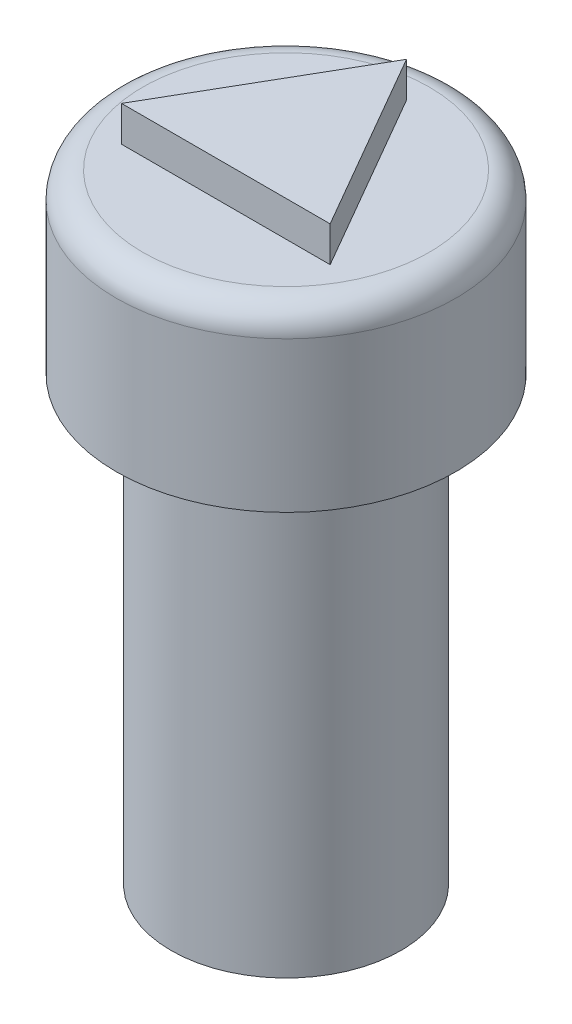
ISO-10303-21;
HEADER;
FILE_DESCRIPTION(('STEP AP214'),'2;1');
FILE_NAME('part.step','',(''),(''),'','','');
FILE_SCHEMA(('AUTOMOTIVE_DESIGN { 1 0 10303 214 1 1 1 1 }'));
ENDSEC;
DATA;
#1=APPLICATION_CONTEXT('core data for automotive mechanical design processes');
#2=APPLICATION_PROTOCOL_DEFINITION('international standard','automotive_design',2000,#1);
#3=PRODUCT_CONTEXT('',#1,'mechanical');
#4=PRODUCT('Part','Part','',(#3));
#5=PRODUCT_RELATED_PRODUCT_CATEGORY('part','',(#4));
#6=PRODUCT_DEFINITION_FORMATION('','',#4);
#7=PRODUCT_DEFINITION_CONTEXT('part definition',#1,'design');
#8=PRODUCT_DEFINITION('design','',#6,#7);
#9=PRODUCT_DEFINITION_SHAPE('','',#8);
#10=(LENGTH_UNIT() NAMED_UNIT(*) SI_UNIT(.MILLI.,.METRE.));
#11=(NAMED_UNIT(*) PLANE_ANGLE_UNIT() SI_UNIT($,.RADIAN.));
#12=(NAMED_UNIT(*) SI_UNIT($,.STERADIAN.) SOLID_ANGLE_UNIT());
#13=UNCERTAINTY_MEASURE_WITH_UNIT(LENGTH_MEASURE(1.E-05),#10,'distance_accuracy_value','');
#14=(GEOMETRIC_REPRESENTATION_CONTEXT(3) GLOBAL_UNCERTAINTY_ASSIGNED_CONTEXT((#13)) GLOBAL_UNIT_ASSIGNED_CONTEXT((#10,
#11,#12)) REPRESENTATION_CONTEXT('',''));
#15=CARTESIAN_POINT('',(0.,0.,0.));
#16=DIRECTION('',(0.,0.,1.));
#17=DIRECTION('',(1.,0.,0.));
#18=AXIS2_PLACEMENT_3D('',#15,#16,#17);
#19=CARTESIAN_POINT('',(0.,12.5,0.));
#20=DIRECTION('',(0.,-1.,0.));
#21=DIRECTION('',(0.,0.,-1.));
#22=AXIS2_PLACEMENT_3D('',#19,#20,#21);
#23=CYLINDRICAL_SURFACE('',#22,3.25);
#24=CARTESIAN_POINT('',(0.,12.5,0.));
#25=DIRECTION('',(0.,1.,0.));
#26=DIRECTION('',(0.,0.,1.));
#27=AXIS2_PLACEMENT_3D('',#24,#25,#26);
#28=CIRCLE('',#27,3.25);
#29=CARTESIAN_POINT('',(0.,12.5,3.25));
#30=VERTEX_POINT('',#29);
#31=EDGE_CURVE('E167',#30,#30,#28,.T.);
#32=ORIENTED_EDGE('',*,*,#31,.F.);
#33=EDGE_LOOP('',(#32));
#34=FACE_BOUND('',#33,.T.);
#35=CARTESIAN_POINT('',(0.,0.,0.));
#36=DIRECTION('',(0.,1.,0.));
#37=DIRECTION('',(0.,0.,1.));
#38=AXIS2_PLACEMENT_3D('',#35,#36,#37);
#39=CIRCLE('',#38,3.25);
#40=CARTESIAN_POINT('',(0.,0.,3.25));
#41=VERTEX_POINT('',#40);
#42=EDGE_CURVE('E164',#41,#41,#39,.T.);
#43=ORIENTED_EDGE('',*,*,#42,.T.);
#44=EDGE_LOOP('',(#43));
#45=FACE_BOUND('',#44,.T.);
#46=ADVANCED_FACE('F99',(#34,#45),#23,.T.);
#47=CARTESIAN_POINT('',(0.,0.,0.));
#48=DIRECTION('',(0.,1.,0.));
#49=DIRECTION('',(0.,0.,1.));
#50=AXIS2_PLACEMENT_3D('',#47,#48,#49);
#51=PLANE('',#50);
#52=CARTESIAN_POINT('',(0.,0.,0.));
#53=DIRECTION('',(0.,-1.,0.));
#54=DIRECTION('',(0.,0.,-1.));
#55=AXIS2_PLACEMENT_3D('',#52,#53,#54);
#56=CIRCLE('',#55,1.75);
#57=CARTESIAN_POINT('',(0.,0.,-1.75));
#58=VERTEX_POINT('',#57);
#59=EDGE_CURVE('E155',#58,#58,#56,.T.);
#60=ORIENTED_EDGE('',*,*,#59,.F.);
#61=EDGE_LOOP('',(#60));
#62=FACE_BOUND('',#61,.T.);
#63=ORIENTED_EDGE('',*,*,#42,.F.);
#64=EDGE_LOOP('',(#63));
#65=FACE_BOUND('',#64,.T.);
#66=ADVANCED_FACE('F186',(#62,#65),#51,.F.);
#67=CARTESIAN_POINT('',(0.,2.5,0.));
#68=DIRECTION('',(0.,-1.,0.));
#69=DIRECTION('',(0.,0.,-1.));
#70=AXIS2_PLACEMENT_3D('',#67,#68,#69);
#71=CYLINDRICAL_SURFACE('',#70,1.75);
#72=CARTESIAN_POINT('',(0.,2.5,0.));
#73=DIRECTION('',(0.,-1.,0.));
#74=DIRECTION('',(0.,0.,-1.));
#75=AXIS2_PLACEMENT_3D('',#72,#73,#74);
#76=CIRCLE('',#75,1.75);
#77=CARTESIAN_POINT('',(0.,2.5,-1.75));
#78=VERTEX_POINT('',#77);
#79=EDGE_CURVE('E161',#78,#78,#76,.T.);
#80=ORIENTED_EDGE('',*,*,#79,.F.);
#81=EDGE_LOOP('',(#80));
#82=FACE_BOUND('',#81,.T.);
#83=ORIENTED_EDGE('',*,*,#59,.T.);
#84=EDGE_LOOP('',(#83));
#85=FACE_BOUND('',#84,.T.);
#86=ADVANCED_FACE('F191',(#82,#85),#71,.F.);
#87=CARTESIAN_POINT('',(0.,2.5,0.));
#88=DIRECTION('',(0.,-1.,0.));
#89=DIRECTION('',(0.,0.,-1.));
#90=AXIS2_PLACEMENT_3D('',#87,#88,#89);
#91=PLANE('',#90);
#92=ORIENTED_EDGE('',*,*,#79,.T.);
#93=EDGE_LOOP('',(#92));
#94=FACE_BOUND('',#93,.T.);
#95=ADVANCED_FACE('F199',(#94),#91,.T.);
#96=CARTESIAN_POINT('',(0.,17.5,0.));
#97=DIRECTION('',(0.,-1.,0.));
#98=DIRECTION('',(0.,0.,-1.));
#99=AXIS2_PLACEMENT_3D('',#96,#97,#98);
#100=CYLINDRICAL_SURFACE('',#99,4.8);
#101=CARTESIAN_POINT('',(0.,16.75,0.));
#102=DIRECTION('',(0.,1.,0.));
#103=DIRECTION('',(0.,0.,1.));
#104=AXIS2_PLACEMENT_3D('',#101,#102,#103);
#105=CIRCLE('',#104,4.8);
#106=CARTESIAN_POINT('',(0.,16.75,4.8));
#107=VERTEX_POINT('',#106);
#108=EDGE_CURVE('E12',#107,#107,#105,.F.);
#109=ORIENTED_EDGE('',*,*,#108,.T.);
#110=EDGE_LOOP('',(#109));
#111=FACE_BOUND('',#110,.T.);
#112=CARTESIAN_POINT('',(0.,12.5,0.));
#113=DIRECTION('',(0.,1.,0.));
#114=DIRECTION('',(0.,0.,1.));
#115=AXIS2_PLACEMENT_3D('',#112,#113,#114);
#116=CIRCLE('',#115,4.8);
#117=CARTESIAN_POINT('',(0.,12.5,4.8));
#118=VERTEX_POINT('',#117);
#119=EDGE_CURVE('E152',#118,#118,#116,.T.);
#120=ORIENTED_EDGE('',*,*,#119,.T.);
#121=EDGE_LOOP('',(#120));
#122=FACE_BOUND('',#121,.T.);
#123=ADVANCED_FACE('F203',(#111,#122),#100,.T.);
#124=CARTESIAN_POINT('',(0.,17.5,0.));
#125=DIRECTION('',(0.,1.,0.));
#126=DIRECTION('',(0.,0.,1.));
#127=AXIS2_PLACEMENT_3D('',#124,#125,#126);
#128=PLANE('',#127);
#129=CARTESIAN_POINT('',(0.,17.5,0.));
#130=DIRECTION('',(0.,1.,0.));
#131=DIRECTION('',(0.,0.,1.));
#132=AXIS2_PLACEMENT_3D('',#129,#130,#131);
#133=CIRCLE('',#132,4.05);
#134=CARTESIAN_POINT('',(0.,17.5,4.05));
#135=VERTEX_POINT('',#134);
#136=EDGE_CURVE('E107',#135,#135,#133,.T.);
#137=ORIENTED_EDGE('',*,*,#136,.T.);
#138=EDGE_LOOP('',(#137));
#139=FACE_BOUND('',#138,.T.);
#140=DIRECTION('',(1.,0.,0.));
#141=VECTOR('',#140,1.);
#142=CARTESIAN_POINT('',(-2.95,17.5,1.7031832941094));
#143=LINE('',#142,#141);
#144=CARTESIAN_POINT('',(-2.95,17.5,1.7031832941094));
#145=VERTEX_POINT('',#144);
#146=CARTESIAN_POINT('',(2.95,17.5,1.7031832941094));
#147=VERTEX_POINT('',#146);
#148=EDGE_CURVE('E114',#145,#147,#143,.T.);
#149=ORIENTED_EDGE('',*,*,#148,.F.);
#150=DIRECTION('',(-0.500000000000001,0.,0.866025403784438));
#151=VECTOR('',#150,1.);
#152=CARTESIAN_POINT('',(0.,17.5,-3.40636658821879));
#153=LINE('',#152,#151);
#154=CARTESIAN_POINT('',(0.,17.5,-3.40636658821879));
#155=VERTEX_POINT('',#154);
#156=EDGE_CURVE('E149',#155,#145,#153,.T.);
#157=ORIENTED_EDGE('',*,*,#156,.F.);
#158=DIRECTION('',(-0.499999999999999,0.,-0.866025403784439));
#159=VECTOR('',#158,1.);
#160=CARTESIAN_POINT('',(2.95,17.5,1.7031832941094));
#161=LINE('',#160,#159);
#162=EDGE_CURVE('E118',#147,#155,#161,.T.);
#163=ORIENTED_EDGE('',*,*,#162,.F.);
#164=EDGE_LOOP('',(#149,#157,#163));
#165=FACE_BOUND('',#164,.T.);
#166=ADVANCED_FACE('F174',(#139,#165),#128,.T.);
#167=CARTESIAN_POINT('',(0.,12.5,0.));
#168=DIRECTION('',(0.,1.,0.));
#169=DIRECTION('',(0.,0.,1.));
#170=AXIS2_PLACEMENT_3D('',#167,#168,#169);
#171=PLANE('',#170);
#172=ORIENTED_EDGE('',*,*,#31,.T.);
#173=EDGE_LOOP('',(#172));
#174=FACE_BOUND('',#173,.T.);
#175=ORIENTED_EDGE('',*,*,#119,.F.);
#176=EDGE_LOOP('',(#175));
#177=FACE_BOUND('',#176,.T.);
#178=ADVANCED_FACE('F208',(#174,#177),#171,.F.);
#179=CARTESIAN_POINT('',(-2.95,18.5,1.7031832941094));
#180=DIRECTION('',(0.,0.,-1.));
#181=DIRECTION('',(-1.,0.,0.));
#182=AXIS2_PLACEMENT_3D('',#179,#180,#181);
#183=PLANE('',#182);
#184=ORIENTED_EDGE('',*,*,#148,.T.);
#185=DIRECTION('',(0.,-1.,0.));
#186=VECTOR('',#185,1.);
#187=CARTESIAN_POINT('',(2.95,18.5,1.7031832941094));
#188=LINE('',#187,#186);
#189=CARTESIAN_POINT('',(2.95,18.5,1.7031832941094));
#190=VERTEX_POINT('',#189);
#191=EDGE_CURVE('E136',#190,#147,#188,.T.);
#192=ORIENTED_EDGE('',*,*,#191,.F.);
#193=DIRECTION('',(1.,0.,0.));
#194=VECTOR('',#193,1.);
#195=CARTESIAN_POINT('',(-2.95,18.5,1.7031832941094));
#196=LINE('',#195,#194);
#197=CARTESIAN_POINT('',(-2.95,18.5,1.7031832941094));
#198=VERTEX_POINT('',#197);
#199=EDGE_CURVE('E142',#198,#190,#196,.T.);
#200=ORIENTED_EDGE('',*,*,#199,.F.);
#201=DIRECTION('',(0.,-1.,0.));
#202=VECTOR('',#201,1.);
#203=CARTESIAN_POINT('',(-2.95,18.5,1.7031832941094));
#204=LINE('',#203,#202);
#205=EDGE_CURVE('E157',#198,#145,#204,.T.);
#206=ORIENTED_EDGE('',*,*,#205,.T.);
#207=EDGE_LOOP('',(#184,#192,#200,#206));
#208=FACE_BOUND('',#207,.T.);
#209=ADVANCED_FACE('F151',(#208),#183,.F.);
#210=CARTESIAN_POINT('',(2.95,18.5,1.7031832941094));
#211=DIRECTION('',(-0.866025403784439,0.,0.5));
#212=DIRECTION('',(0.5,0.,0.866025403784439));
#213=AXIS2_PLACEMENT_3D('',#210,#211,#212);
#214=PLANE('',#213);
#215=ORIENTED_EDGE('',*,*,#162,.T.);
#216=DIRECTION('',(0.,-1.,0.));
#217=VECTOR('',#216,1.);
#218=CARTESIAN_POINT('',(0.,18.5,-3.40636658821879));
#219=LINE('',#218,#217);
#220=CARTESIAN_POINT('',(0.,18.5,-3.40636658821879));
#221=VERTEX_POINT('',#220);
#222=EDGE_CURVE('E138',#221,#155,#219,.T.);
#223=ORIENTED_EDGE('',*,*,#222,.F.);
#224=DIRECTION('',(-0.499999999999999,0.,-0.866025403784439));
#225=VECTOR('',#224,1.);
#226=CARTESIAN_POINT('',(2.95,18.5,1.7031832941094));
#227=LINE('',#226,#225);
#228=EDGE_CURVE('E132',#190,#221,#227,.T.);
#229=ORIENTED_EDGE('',*,*,#228,.F.);
#230=ORIENTED_EDGE('',*,*,#191,.T.);
#231=EDGE_LOOP('',(#215,#223,#229,#230));
#232=FACE_BOUND('',#231,.T.);
#233=ADVANCED_FACE('F134',(#232),#214,.F.);
#234=CARTESIAN_POINT('',(0.,18.5,-3.40636658821879));
#235=DIRECTION('',(0.866025403784438,0.,0.500000000000001));
#236=DIRECTION('',(0.500000000000001,0.,-0.866025403784438));
#237=AXIS2_PLACEMENT_3D('',#234,#235,#236);
#238=PLANE('',#237);
#239=ORIENTED_EDGE('',*,*,#156,.T.);
#240=ORIENTED_EDGE('',*,*,#205,.F.);
#241=DIRECTION('',(-0.500000000000001,0.,0.866025403784438));
#242=VECTOR('',#241,1.);
#243=CARTESIAN_POINT('',(0.,18.5,-3.40636658821879));
#244=LINE('',#243,#242);
#245=EDGE_CURVE('E141',#221,#198,#244,.T.);
#246=ORIENTED_EDGE('',*,*,#245,.F.);
#247=ORIENTED_EDGE('',*,*,#222,.T.);
#248=EDGE_LOOP('',(#239,#240,#246,#247));
#249=FACE_BOUND('',#248,.T.);
#250=ADVANCED_FACE('F182',(#249),#238,.F.);
#251=CARTESIAN_POINT('',(0.,18.5,0.));
#252=DIRECTION('',(0.,1.,0.));
#253=DIRECTION('',(0.,0.,1.));
#254=AXIS2_PLACEMENT_3D('',#251,#252,#253);
#255=PLANE('',#254);
#256=ORIENTED_EDGE('',*,*,#199,.T.);
#257=ORIENTED_EDGE('',*,*,#228,.T.);
#258=ORIENTED_EDGE('',*,*,#245,.T.);
#259=EDGE_LOOP('',(#256,#257,#258));
#260=FACE_BOUND('',#259,.T.);
#261=ADVANCED_FACE('F145',(#260),#255,.T.);
#262=CARTESIAN_POINT('',(0.,16.75,0.));
#263=DIRECTION('',(0.,1.,0.));
#264=DIRECTION('',(0.,0.,1.));
#265=AXIS2_PLACEMENT_3D('',#262,#263,#264);
#266=TOROIDAL_SURFACE('',#265,4.05,0.75);
#267=ORIENTED_EDGE('',*,*,#108,.F.);
#268=EDGE_LOOP('',(#267));
#269=FACE_BOUND('',#268,.T.);
#270=ORIENTED_EDGE('',*,*,#136,.F.);
#271=EDGE_LOOP('',(#270));
#272=FACE_BOUND('',#271,.T.);
#273=ADVANCED_FACE('F101',(#269,#272),#266,.T.);
#274=CLOSED_SHELL('',(#46,#66,#86,#95,#123,#166,#178,#209,#233,#250,#261,#273));
#275=MANIFOLD_SOLID_BREP('B2',#274);
#276=ADVANCED_BREP_SHAPE_REPRESENTATION('',(#18,#275),#14);
#277=SHAPE_DEFINITION_REPRESENTATION(#9,#276);
ENDSEC;
END-ISO-10303-21;
